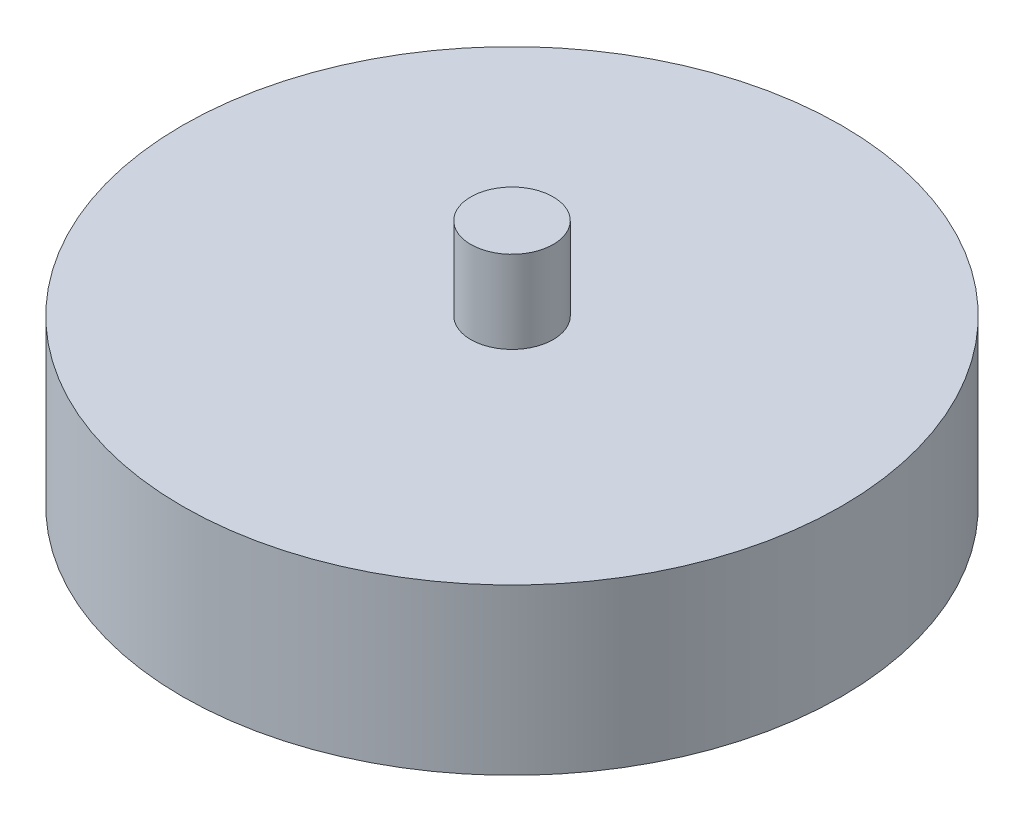
ISO-10303-21;
HEADER;
FILE_DESCRIPTION(('STEP AP214'),'2;1');
FILE_NAME('part.step','',(''),(''),'','','');
FILE_SCHEMA(('AUTOMOTIVE_DESIGN { 1 0 10303 214 1 1 1 1 }'));
ENDSEC;
DATA;
#1=APPLICATION_CONTEXT('core data for automotive mechanical design processes');
#2=APPLICATION_PROTOCOL_DEFINITION('international standard','automotive_design',2000,#1);
#3=PRODUCT_CONTEXT('',#1,'mechanical');
#4=PRODUCT('Part','Part','',(#3));
#5=PRODUCT_RELATED_PRODUCT_CATEGORY('part','',(#4));
#6=PRODUCT_DEFINITION_FORMATION('','',#4);
#7=PRODUCT_DEFINITION_CONTEXT('part definition',#1,'design');
#8=PRODUCT_DEFINITION('design','',#6,#7);
#9=PRODUCT_DEFINITION_SHAPE('','',#8);
#10=(LENGTH_UNIT() NAMED_UNIT(*) SI_UNIT(.MILLI.,.METRE.));
#11=(NAMED_UNIT(*) PLANE_ANGLE_UNIT() SI_UNIT($,.RADIAN.));
#12=(NAMED_UNIT(*) SI_UNIT($,.STERADIAN.) SOLID_ANGLE_UNIT());
#13=UNCERTAINTY_MEASURE_WITH_UNIT(LENGTH_MEASURE(1.E-05),#10,'distance_accuracy_value','');
#14=(GEOMETRIC_REPRESENTATION_CONTEXT(3) GLOBAL_UNCERTAINTY_ASSIGNED_CONTEXT((#13)) GLOBAL_UNIT_ASSIGNED_CONTEXT((#10,
#11,#12)) REPRESENTATION_CONTEXT('',''));
#15=CARTESIAN_POINT('',(0.,0.,0.));
#16=DIRECTION('',(0.,0.,1.));
#17=DIRECTION('',(1.,0.,0.));
#18=AXIS2_PLACEMENT_3D('',#15,#16,#17);
#19=CARTESIAN_POINT('',(0.,50.8,0.));
#20=DIRECTION('',(0.,-1.,0.));
#21=DIRECTION('',(0.,0.,-1.));
#22=AXIS2_PLACEMENT_3D('',#19,#20,#21);
#23=CYLINDRICAL_SURFACE('',#22,101.6);
#24=CARTESIAN_POINT('',(0.,50.8,0.));
#25=DIRECTION('',(0.,1.,0.));
#26=DIRECTION('',(0.,0.,1.));
#27=AXIS2_PLACEMENT_3D('',#24,#25,#26);
#28=CIRCLE('',#27,101.6);
#29=CARTESIAN_POINT('',(0.,50.8,101.6));
#30=VERTEX_POINT('',#29);
#31=EDGE_CURVE('E10',#30,#30,#28,.T.);
#32=ORIENTED_EDGE('',*,*,#31,.F.);
#33=EDGE_LOOP('',(#32));
#34=FACE_BOUND('',#33,.T.);
#35=CARTESIAN_POINT('',(0.,0.,0.));
#36=DIRECTION('',(0.,1.,0.));
#37=DIRECTION('',(0.,0.,1.));
#38=AXIS2_PLACEMENT_3D('',#35,#36,#37);
#39=CIRCLE('',#38,101.6);
#40=CARTESIAN_POINT('',(0.,0.,101.6));
#41=VERTEX_POINT('',#40);
#42=EDGE_CURVE('E35',#41,#41,#39,.T.);
#43=ORIENTED_EDGE('',*,*,#42,.T.);
#44=EDGE_LOOP('',(#43));
#45=FACE_BOUND('',#44,.T.);
#46=ADVANCED_FACE('F32',(#34,#45),#23,.T.);
#47=CARTESIAN_POINT('',(0.,50.8,0.));
#48=DIRECTION('',(0.,1.,0.));
#49=DIRECTION('',(0.,0.,1.));
#50=AXIS2_PLACEMENT_3D('',#47,#48,#49);
#51=PLANE('',#50);
#52=CARTESIAN_POINT('',(0.,50.8,0.));
#53=DIRECTION('',(0.,1.,0.));
#54=DIRECTION('',(0.,0.,1.));
#55=AXIS2_PLACEMENT_3D('',#52,#53,#54);
#56=CIRCLE('',#55,12.7);
#57=CARTESIAN_POINT('',(0.,50.8,12.7));
#58=VERTEX_POINT('',#57);
#59=EDGE_CURVE('E44',#58,#58,#56,.T.);
#60=ORIENTED_EDGE('',*,*,#59,.F.);
#61=EDGE_LOOP('',(#60));
#62=FACE_BOUND('',#61,.T.);
#63=ORIENTED_EDGE('',*,*,#31,.T.);
#64=EDGE_LOOP('',(#63));
#65=FACE_BOUND('',#64,.T.);
#66=ADVANCED_FACE('F59',(#62,#65),#51,.T.);
#67=CARTESIAN_POINT('',(0.,0.,0.));
#68=DIRECTION('',(0.,1.,0.));
#69=DIRECTION('',(0.,0.,1.));
#70=AXIS2_PLACEMENT_3D('',#67,#68,#69);
#71=PLANE('',#70);
#72=ORIENTED_EDGE('',*,*,#42,.F.);
#73=EDGE_LOOP('',(#72));
#74=FACE_BOUND('',#73,.T.);
#75=ADVANCED_FACE('F55',(#74),#71,.F.);
#76=CARTESIAN_POINT('',(0.,76.2,0.));
#77=DIRECTION('',(0.,-1.,0.));
#78=DIRECTION('',(0.,0.,-1.));
#79=AXIS2_PLACEMENT_3D('',#76,#77,#78);
#80=CYLINDRICAL_SURFACE('',#79,12.7);
#81=CARTESIAN_POINT('',(0.,76.2,0.));
#82=DIRECTION('',(0.,1.,0.));
#83=DIRECTION('',(0.,0.,1.));
#84=AXIS2_PLACEMENT_3D('',#81,#82,#83);
#85=CIRCLE('',#84,12.7);
#86=CARTESIAN_POINT('',(0.,76.2,12.7));
#87=VERTEX_POINT('',#86);
#88=EDGE_CURVE('E42',#87,#87,#85,.T.);
#89=ORIENTED_EDGE('',*,*,#88,.F.);
#90=EDGE_LOOP('',(#89));
#91=FACE_BOUND('',#90,.T.);
#92=ORIENTED_EDGE('',*,*,#59,.T.);
#93=EDGE_LOOP('',(#92));
#94=FACE_BOUND('',#93,.T.);
#95=ADVANCED_FACE('F52',(#91,#94),#80,.T.);
#96=CARTESIAN_POINT('',(0.,76.2,0.));
#97=DIRECTION('',(0.,1.,0.));
#98=DIRECTION('',(0.,0.,1.));
#99=AXIS2_PLACEMENT_3D('',#96,#97,#98);
#100=PLANE('',#99);
#101=ORIENTED_EDGE('',*,*,#88,.T.);
#102=EDGE_LOOP('',(#101));
#103=FACE_BOUND('',#102,.T.);
#104=ADVANCED_FACE('F50',(#103),#100,.T.);
#105=CLOSED_SHELL('',(#46,#66,#75,#95,#104));
#106=MANIFOLD_SOLID_BREP('B2',#105);
#107=ADVANCED_BREP_SHAPE_REPRESENTATION('',(#18,#106),#14);
#108=SHAPE_DEFINITION_REPRESENTATION(#9,#107);
ENDSEC;
END-ISO-10303-21;
